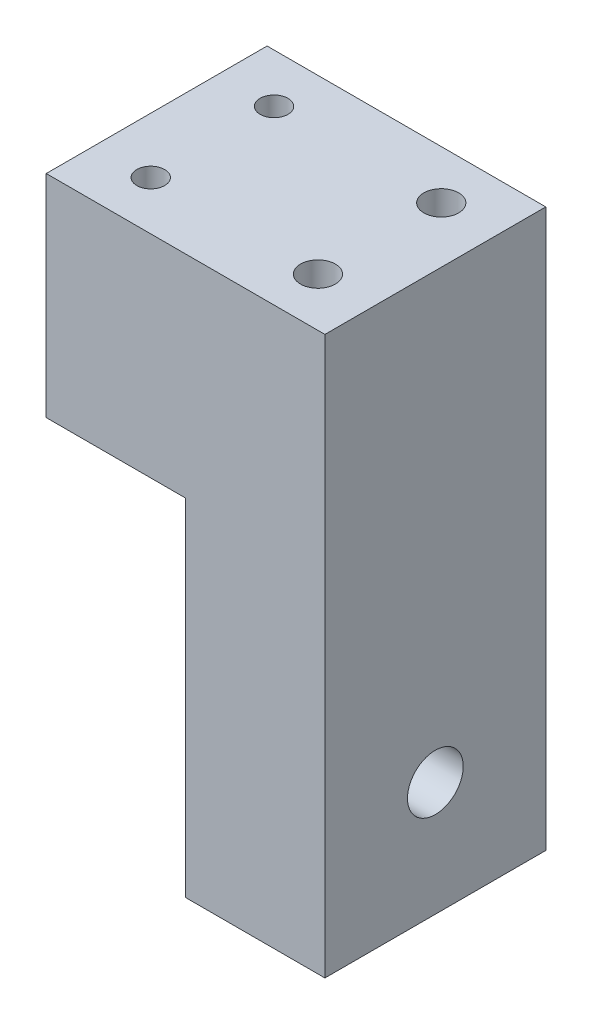
ISO-10303-21;
HEADER;
FILE_DESCRIPTION(('STEP AP214'),'2;1');
FILE_NAME('part.step','',(''),(''),'','','');
FILE_SCHEMA(('AUTOMOTIVE_DESIGN { 1 0 10303 214 1 1 1 1 }'));
ENDSEC;
DATA;
#1=APPLICATION_CONTEXT('core data for automotive mechanical design processes');
#2=APPLICATION_PROTOCOL_DEFINITION('international standard','automotive_design',2000,#1);
#3=PRODUCT_CONTEXT('',#1,'mechanical');
#4=PRODUCT('Part','Part','',(#3));
#5=PRODUCT_RELATED_PRODUCT_CATEGORY('part','',(#4));
#6=PRODUCT_DEFINITION_FORMATION('','',#4);
#7=PRODUCT_DEFINITION_CONTEXT('part definition',#1,'design');
#8=PRODUCT_DEFINITION('design','',#6,#7);
#9=PRODUCT_DEFINITION_SHAPE('','',#8);
#10=(LENGTH_UNIT() NAMED_UNIT(*) SI_UNIT(.MILLI.,.METRE.));
#11=(NAMED_UNIT(*) PLANE_ANGLE_UNIT() SI_UNIT($,.RADIAN.));
#12=(NAMED_UNIT(*) SI_UNIT($,.STERADIAN.) SOLID_ANGLE_UNIT());
#13=UNCERTAINTY_MEASURE_WITH_UNIT(LENGTH_MEASURE(1.E-05),#10,'distance_accuracy_value','');
#14=(GEOMETRIC_REPRESENTATION_CONTEXT(3) GLOBAL_UNCERTAINTY_ASSIGNED_CONTEXT((#13)) GLOBAL_UNIT_ASSIGNED_CONTEXT((#10,
#11,#12)) REPRESENTATION_CONTEXT('',''));
#15=CARTESIAN_POINT('',(0.,0.,0.));
#16=DIRECTION('',(0.,0.,1.));
#17=DIRECTION('',(1.,0.,0.));
#18=AXIS2_PLACEMENT_3D('',#15,#16,#17);
#19=CARTESIAN_POINT('',(-4.34310787671234,80.,-11.796875));
#20=DIRECTION('',(1.,0.,0.));
#21=DIRECTION('',(0.,0.,-1.));
#22=AXIS2_PLACEMENT_3D('',#19,#20,#21);
#23=PLANE('',#22);
#24=CARTESIAN_POINT('',(-4.34310787671234,16.3903547365967,4.05312500000005));
#25=DIRECTION('',(-1.,0.,0.));
#26=DIRECTION('',(0.,0.,1.));
#27=AXIS2_PLACEMENT_3D('',#24,#25,#26);
#28=CIRCLE('',#27,4.);
#29=CARTESIAN_POINT('',(-4.34310787671234,16.3903547365967,8.05312500000005));
#30=VERTEX_POINT('',#29);
#31=EDGE_CURVE('E103',#30,#30,#28,.T.);
#32=ORIENTED_EDGE('',*,*,#31,.F.);
#33=EDGE_LOOP('',(#32));
#34=FACE_BOUND('',#33,.T.);
#35=CARTESIAN_POINT('',(-4.34310787671234,3.83920937053546,16.6042703660613));
#36=DIRECTION('',(-1.,0.,0.));
#37=DIRECTION('',(0.,0.,1.));
#38=AXIS2_PLACEMENT_3D('',#35,#36,#37);
#39=CIRCLE('',#38,1.24999999999999);
#40=CARTESIAN_POINT('',(-4.34310787671234,3.83920937053546,17.8542703660612));
#41=VERTEX_POINT('',#40);
#42=EDGE_CURVE('E164',#41,#41,#39,.T.);
#43=ORIENTED_EDGE('',*,*,#42,.F.);
#44=EDGE_LOOP('',(#43));
#45=FACE_BOUND('',#44,.T.);
#46=CARTESIAN_POINT('',(-4.34310787671234,3.83920937053546,-8.49802036606119));
#47=DIRECTION('',(-1.,0.,0.));
#48=DIRECTION('',(0.,0.,1.));
#49=AXIS2_PLACEMENT_3D('',#46,#47,#48);
#50=CIRCLE('',#49,1.24999999999999);
#51=CARTESIAN_POINT('',(-4.34310787671234,3.83920937053546,-7.2480203660612));
#52=VERTEX_POINT('',#51);
#53=EDGE_CURVE('E158',#52,#52,#50,.T.);
#54=ORIENTED_EDGE('',*,*,#53,.F.);
#55=EDGE_LOOP('',(#54));
#56=FACE_BOUND('',#55,.T.);
#57=CARTESIAN_POINT('',(-4.34310787671234,28.9415001026579,-8.49802036606118));
#58=DIRECTION('',(-1.,0.,0.));
#59=DIRECTION('',(0.,0.,1.));
#60=AXIS2_PLACEMENT_3D('',#57,#58,#59);
#61=CIRCLE('',#60,1.24999999999999);
#62=CARTESIAN_POINT('',(-4.34310787671234,28.9415001026579,-7.2480203660612));
#63=VERTEX_POINT('',#62);
#64=EDGE_CURVE('E152',#63,#63,#61,.T.);
#65=ORIENTED_EDGE('',*,*,#64,.F.);
#66=EDGE_LOOP('',(#65));
#67=FACE_BOUND('',#66,.T.);
#68=CARTESIAN_POINT('',(-4.34310787671234,28.9415001026579,16.6042703660613));
#69=DIRECTION('',(-1.,0.,0.));
#70=DIRECTION('',(0.,0.,1.));
#71=AXIS2_PLACEMENT_3D('',#68,#69,#70);
#72=CIRCLE('',#71,1.24999999999999);
#73=CARTESIAN_POINT('',(-4.34310787671234,28.9415001026579,17.8542703660613));
#74=VERTEX_POINT('',#73);
#75=EDGE_CURVE('E146',#74,#74,#72,.T.);
#76=ORIENTED_EDGE('',*,*,#75,.F.);
#77=EDGE_LOOP('',(#76));
#78=FACE_BOUND('',#77,.T.);
#79=DIRECTION('',(0.,0.,1.));
#80=VECTOR('',#79,1.);
#81=CARTESIAN_POINT('',(-4.34310787671234,49.655452772484,-11.796875));
#82=LINE('',#81,#80);
#83=CARTESIAN_POINT('',(-4.34310787671234,49.655452772484,-11.796875));
#84=VERTEX_POINT('',#83);
#85=CARTESIAN_POINT('',(-4.34310787671234,49.655452772484,19.903125));
#86=VERTEX_POINT('',#85);
#87=EDGE_CURVE('E52',#84,#86,#82,.T.);
#88=ORIENTED_EDGE('',*,*,#87,.F.);
#89=DIRECTION('',(0.,-1.,0.));
#90=VECTOR('',#89,1.);
#91=CARTESIAN_POINT('',(-4.34310787671234,80.,-11.796875));
#92=LINE('',#91,#90);
#93=CARTESIAN_POINT('',(-4.34310787671234,0.,-11.796875));
#94=VERTEX_POINT('',#93);
#95=EDGE_CURVE('E76',#84,#94,#92,.T.);
#96=ORIENTED_EDGE('',*,*,#95,.T.);
#97=DIRECTION('',(0.,0.,1.));
#98=VECTOR('',#97,1.);
#99=CARTESIAN_POINT('',(-4.34310787671234,0.,-11.796875));
#100=LINE('',#99,#98);
#101=CARTESIAN_POINT('',(-4.34310787671234,0.,19.903125));
#102=VERTEX_POINT('',#101);
#103=EDGE_CURVE('E79',#94,#102,#100,.T.);
#104=ORIENTED_EDGE('',*,*,#103,.T.);
#105=DIRECTION('',(0.,-1.,0.));
#106=VECTOR('',#105,1.);
#107=CARTESIAN_POINT('',(-4.34310787671234,80.,19.903125));
#108=LINE('',#107,#106);
#109=EDGE_CURVE('E11',#86,#102,#108,.T.);
#110=ORIENTED_EDGE('',*,*,#109,.F.);
#111=EDGE_LOOP('',(#88,#96,#104,#110));
#112=FACE_BOUND('',#111,.T.);
#113=ADVANCED_FACE('F38',(#34,#45,#56,#67,#78,#112),#23,.F.);
#114=CARTESIAN_POINT('',(-4.34310787671234,80.,19.903125));
#115=DIRECTION('',(0.,0.,-1.));
#116=DIRECTION('',(-1.,0.,0.));
#117=AXIS2_PLACEMENT_3D('',#114,#115,#116);
#118=PLANE('',#117);
#119=DIRECTION('',(1.,0.,0.));
#120=VECTOR('',#119,1.);
#121=CARTESIAN_POINT('',(-4.34310787671234,0.,19.903125));
#122=LINE('',#121,#120);
#123=CARTESIAN_POINT('',(15.6568921232877,0.,19.903125));
#124=VERTEX_POINT('',#123);
#125=EDGE_CURVE('E98',#102,#124,#122,.T.);
#126=ORIENTED_EDGE('',*,*,#125,.T.);
#127=DIRECTION('',(0.,-1.,0.));
#128=VECTOR('',#127,1.);
#129=CARTESIAN_POINT('',(15.6568921232877,80.,19.903125));
#130=LINE('',#129,#128);
#131=CARTESIAN_POINT('',(15.6568921232877,80.,19.903125));
#132=VERTEX_POINT('',#131);
#133=EDGE_CURVE('E45',#132,#124,#130,.T.);
#134=ORIENTED_EDGE('',*,*,#133,.F.);
#135=DIRECTION('',(1.,0.,0.));
#136=VECTOR('',#135,1.);
#137=CARTESIAN_POINT('',(-4.34310787671234,80.,19.903125));
#138=LINE('',#137,#136);
#139=CARTESIAN_POINT('',(-24.3431078767123,80.,19.903125));
#140=VERTEX_POINT('',#139);
#141=EDGE_CURVE('E93',#140,#132,#138,.T.);
#142=ORIENTED_EDGE('',*,*,#141,.F.);
#143=DIRECTION('',(0.,1.,0.));
#144=VECTOR('',#143,1.);
#145=CARTESIAN_POINT('',(-24.3431078767123,49.655452772484,19.903125));
#146=LINE('',#145,#144);
#147=CARTESIAN_POINT('',(-24.3431078767123,49.655452772484,19.903125));
#148=VERTEX_POINT('',#147);
#149=EDGE_CURVE('E182',#148,#140,#146,.T.);
#150=ORIENTED_EDGE('',*,*,#149,.F.);
#151=DIRECTION('',(1.,0.,0.));
#152=VECTOR('',#151,1.);
#153=CARTESIAN_POINT('',(-24.3431078767123,49.655452772484,19.903125));
#154=LINE('',#153,#152);
#155=EDGE_CURVE('E122',#148,#86,#154,.T.);
#156=ORIENTED_EDGE('',*,*,#155,.T.);
#157=ORIENTED_EDGE('',*,*,#109,.T.);
#158=EDGE_LOOP('',(#126,#134,#142,#150,#156,#157));
#159=FACE_BOUND('',#158,.T.);
#160=ADVANCED_FACE('F115',(#159),#118,.F.);
#161=CARTESIAN_POINT('',(15.6568921232877,80.,-11.796875));
#162=DIRECTION('',(-1.,0.,0.));
#163=DIRECTION('',(0.,0.,1.));
#164=AXIS2_PLACEMENT_3D('',#161,#162,#163);
#165=PLANE('',#164);
#166=CARTESIAN_POINT('',(15.6568921232877,16.3903547365967,4.05312500000005));
#167=DIRECTION('',(-1.,0.,0.));
#168=DIRECTION('',(0.,0.,1.));
#169=AXIS2_PLACEMENT_3D('',#166,#167,#168);
#170=CIRCLE('',#169,4.);
#171=CARTESIAN_POINT('',(15.6568921232877,16.3903547365967,8.05312500000005));
#172=VERTEX_POINT('',#171);
#173=EDGE_CURVE('E99',#172,#172,#170,.F.);
#174=ORIENTED_EDGE('',*,*,#173,.F.);
#175=EDGE_LOOP('',(#174));
#176=FACE_BOUND('',#175,.T.);
#177=DIRECTION('',(0.,0.,-1.));
#178=VECTOR('',#177,1.);
#179=CARTESIAN_POINT('',(15.6568921232877,0.,-11.796875));
#180=LINE('',#179,#178);
#181=CARTESIAN_POINT('',(15.6568921232877,0.,-11.796875));
#182=VERTEX_POINT('',#181);
#183=EDGE_CURVE('E94',#124,#182,#180,.T.);
#184=ORIENTED_EDGE('',*,*,#183,.T.);
#185=DIRECTION('',(0.,-1.,0.));
#186=VECTOR('',#185,1.);
#187=CARTESIAN_POINT('',(15.6568921232877,80.,-11.796875));
#188=LINE('',#187,#186);
#189=CARTESIAN_POINT('',(15.6568921232877,80.,-11.796875));
#190=VERTEX_POINT('',#189);
#191=EDGE_CURVE('E83',#190,#182,#188,.T.);
#192=ORIENTED_EDGE('',*,*,#191,.F.);
#193=DIRECTION('',(0.,0.,-1.));
#194=VECTOR('',#193,1.);
#195=CARTESIAN_POINT('',(15.6568921232877,80.,-11.796875));
#196=LINE('',#195,#194);
#197=EDGE_CURVE('E61',#132,#190,#196,.T.);
#198=ORIENTED_EDGE('',*,*,#197,.F.);
#199=ORIENTED_EDGE('',*,*,#133,.T.);
#200=EDGE_LOOP('',(#184,#192,#198,#199));
#201=FACE_BOUND('',#200,.T.);
#202=ADVANCED_FACE('F112',(#176,#201),#165,.F.);
#203=CARTESIAN_POINT('',(-4.34310787671234,80.,-11.796875));
#204=DIRECTION('',(0.,0.,1.));
#205=DIRECTION('',(1.,0.,0.));
#206=AXIS2_PLACEMENT_3D('',#203,#204,#205);
#207=PLANE('',#206);
#208=DIRECTION('',(-1.,0.,0.));
#209=VECTOR('',#208,1.);
#210=CARTESIAN_POINT('',(-4.34310787671234,0.,-11.796875));
#211=LINE('',#210,#209);
#212=EDGE_CURVE('E88',#182,#94,#211,.T.);
#213=ORIENTED_EDGE('',*,*,#212,.T.);
#214=ORIENTED_EDGE('',*,*,#95,.F.);
#215=DIRECTION('',(1.,0.,0.));
#216=VECTOR('',#215,1.);
#217=CARTESIAN_POINT('',(-24.3431078767123,49.655452772484,-11.796875));
#218=LINE('',#217,#216);
#219=CARTESIAN_POINT('',(-24.3431078767123,49.655452772484,-11.796875));
#220=VERTEX_POINT('',#219);
#221=EDGE_CURVE('E130',#220,#84,#218,.T.);
#222=ORIENTED_EDGE('',*,*,#221,.F.);
#223=DIRECTION('',(0.,-1.,0.));
#224=VECTOR('',#223,1.);
#225=CARTESIAN_POINT('',(-24.3431078767123,49.655452772484,-11.796875));
#226=LINE('',#225,#224);
#227=CARTESIAN_POINT('',(-24.3431078767123,80.,-11.796875));
#228=VERTEX_POINT('',#227);
#229=EDGE_CURVE('E131',#228,#220,#226,.T.);
#230=ORIENTED_EDGE('',*,*,#229,.F.);
#231=DIRECTION('',(-1.,0.,0.));
#232=VECTOR('',#231,1.);
#233=CARTESIAN_POINT('',(-4.34310787671234,80.,-11.796875));
#234=LINE('',#233,#232);
#235=EDGE_CURVE('E84',#190,#228,#234,.T.);
#236=ORIENTED_EDGE('',*,*,#235,.F.);
#237=ORIENTED_EDGE('',*,*,#191,.T.);
#238=EDGE_LOOP('',(#213,#214,#222,#230,#236,#237));
#239=FACE_BOUND('',#238,.T.);
#240=ADVANCED_FACE('F89',(#239),#207,.F.);
#241=CARTESIAN_POINT('',(0.,80.,0.));
#242=DIRECTION('',(0.,1.,0.));
#243=DIRECTION('',(0.,0.,1.));
#244=AXIS2_PLACEMENT_3D('',#241,#242,#243);
#245=PLANE('',#244);
#246=CARTESIAN_POINT('',(7.65689212328766,80.,-4.796875));
#247=DIRECTION('',(0.,1.,0.));
#248=DIRECTION('',(0.,0.,1.));
#249=AXIS2_PLACEMENT_3D('',#246,#247,#248);
#250=CIRCLE('',#249,2.5);
#251=CARTESIAN_POINT('',(7.65689212328766,80.,-2.296875));
#252=VERTEX_POINT('',#251);
#253=EDGE_CURVE('E495',#252,#252,#250,.T.);
#254=ORIENTED_EDGE('',*,*,#253,.F.);
#255=EDGE_LOOP('',(#254));
#256=FACE_BOUND('',#255,.T.);
#257=CARTESIAN_POINT('',(7.65689212328766,80.,12.903125));
#258=DIRECTION('',(0.,1.,0.));
#259=DIRECTION('',(0.,0.,1.));
#260=AXIS2_PLACEMENT_3D('',#257,#258,#259);
#261=CIRCLE('',#260,2.5);
#262=CARTESIAN_POINT('',(7.65689212328766,80.,15.403125));
#263=VERTEX_POINT('',#262);
#264=EDGE_CURVE('E497',#263,#263,#261,.T.);
#265=ORIENTED_EDGE('',*,*,#264,.F.);
#266=EDGE_LOOP('',(#265));
#267=FACE_BOUND('',#266,.T.);
#268=CARTESIAN_POINT('',(-16.3431078767123,80.,-4.796875));
#269=DIRECTION('',(0.,1.,0.));
#270=DIRECTION('',(0.,0.,1.));
#271=AXIS2_PLACEMENT_3D('',#268,#269,#270);
#272=CIRCLE('',#271,1.99999999999999);
#273=CARTESIAN_POINT('',(-16.3431078767123,80.,-2.79687500000001));
#274=VERTEX_POINT('',#273);
#275=EDGE_CURVE('E505',#274,#274,#272,.T.);
#276=ORIENTED_EDGE('',*,*,#275,.F.);
#277=EDGE_LOOP('',(#276));
#278=FACE_BOUND('',#277,.T.);
#279=CARTESIAN_POINT('',(-16.3431078767123,80.,12.903125));
#280=DIRECTION('',(0.,1.,0.));
#281=DIRECTION('',(0.,0.,1.));
#282=AXIS2_PLACEMENT_3D('',#279,#280,#281);
#283=CIRCLE('',#282,1.99999999999999);
#284=CARTESIAN_POINT('',(-16.3431078767123,80.,14.903125));
#285=VERTEX_POINT('',#284);
#286=EDGE_CURVE('E138',#285,#285,#283,.T.);
#287=ORIENTED_EDGE('',*,*,#286,.F.);
#288=EDGE_LOOP('',(#287));
#289=FACE_BOUND('',#288,.T.);
#290=ORIENTED_EDGE('',*,*,#235,.T.);
#291=DIRECTION('',(0.,0.,-1.));
#292=VECTOR('',#291,1.);
#293=CARTESIAN_POINT('',(-24.3431078767123,80.,-11.796875));
#294=LINE('',#293,#292);
#295=EDGE_CURVE('E142',#140,#228,#294,.T.);
#296=ORIENTED_EDGE('',*,*,#295,.F.);
#297=ORIENTED_EDGE('',*,*,#141,.T.);
#298=ORIENTED_EDGE('',*,*,#197,.T.);
#299=EDGE_LOOP('',(#290,#296,#297,#298));
#300=FACE_BOUND('',#299,.T.);
#301=ADVANCED_FACE('F175',(#256,#267,#278,#289,#300),#245,.T.);
#302=CARTESIAN_POINT('',(0.,0.,0.));
#303=DIRECTION('',(0.,1.,0.));
#304=DIRECTION('',(0.,0.,1.));
#305=AXIS2_PLACEMENT_3D('',#302,#303,#304);
#306=PLANE('',#305);
#307=ORIENTED_EDGE('',*,*,#103,.F.);
#308=ORIENTED_EDGE('',*,*,#212,.F.);
#309=ORIENTED_EDGE('',*,*,#183,.F.);
#310=ORIENTED_EDGE('',*,*,#125,.F.);
#311=EDGE_LOOP('',(#307,#308,#309,#310));
#312=FACE_BOUND('',#311,.T.);
#313=ADVANCED_FACE('F97',(#312),#306,.F.);
#314=CARTESIAN_POINT('',(15.6578921232877,16.3903547365967,4.05312500000005));
#315=DIRECTION('',(-1.,0.,0.));
#316=DIRECTION('',(0.,0.,1.));
#317=AXIS2_PLACEMENT_3D('',#314,#315,#316);
#318=CYLINDRICAL_SURFACE('',#317,4.);
#319=ORIENTED_EDGE('',*,*,#31,.T.);
#320=EDGE_LOOP('',(#319));
#321=FACE_BOUND('',#320,.T.);
#322=ORIENTED_EDGE('',*,*,#173,.T.);
#323=EDGE_LOOP('',(#322));
#324=FACE_BOUND('',#323,.T.);
#325=ADVANCED_FACE('F202',(#321,#324),#318,.F.);
#326=CARTESIAN_POINT('',(3.15689212328766,3.83920937053546,16.6042703660613));
#327=DIRECTION('',(-1.,0.,0.));
#328=DIRECTION('',(0.,0.,1.));
#329=AXIS2_PLACEMENT_3D('',#326,#327,#328);
#330=CONICAL_SURFACE('',#329,1.24999999999999,1.02974425867664);
#331=CARTESIAN_POINT('',(3.90796789707212,3.83920937053545,16.6042703660613));
#332=VERTEX_POINT('',#331);
#333=VERTEX_LOOP('',#332);
#334=FACE_BOUND('',#333,.T.);
#335=CARTESIAN_POINT('',(3.15689212328766,3.83920937053546,16.6042703660613));
#336=DIRECTION('',(-1.,0.,0.));
#337=DIRECTION('',(0.,0.,1.));
#338=AXIS2_PLACEMENT_3D('',#335,#336,#337);
#339=CIRCLE('',#338,1.24999999999999);
#340=CARTESIAN_POINT('',(3.15689212328766,3.83920937053546,17.8542703660612));
#341=VERTEX_POINT('',#340);
#342=EDGE_CURVE('E167',#341,#341,#339,.T.);
#343=ORIENTED_EDGE('',*,*,#342,.T.);
#344=EDGE_LOOP('',(#343));
#345=FACE_BOUND('',#344,.T.);
#346=ADVANCED_FACE('F198',(#334,#345),#330,.F.);
#347=CARTESIAN_POINT('',(-4.34310787671234,3.83920937053546,16.6042703660613));
#348=DIRECTION('',(-1.,0.,0.));
#349=DIRECTION('',(0.,0.,1.));
#350=AXIS2_PLACEMENT_3D('',#347,#348,#349);
#351=CYLINDRICAL_SURFACE('',#350,1.24999999999999);
#352=ORIENTED_EDGE('',*,*,#342,.F.);
#353=EDGE_LOOP('',(#352));
#354=FACE_BOUND('',#353,.T.);
#355=ORIENTED_EDGE('',*,*,#42,.T.);
#356=EDGE_LOOP('',(#355));
#357=FACE_BOUND('',#356,.T.);
#358=ADVANCED_FACE('F201',(#354,#357),#351,.F.);
#359=CARTESIAN_POINT('',(3.15689212328765,3.83920937053546,-8.49802036606119));
#360=DIRECTION('',(-1.,0.,0.));
#361=DIRECTION('',(0.,0.,1.));
#362=AXIS2_PLACEMENT_3D('',#359,#360,#361);
#363=CONICAL_SURFACE('',#362,1.24999999999999,1.02974425867664);
#364=CARTESIAN_POINT('',(3.90796789707211,3.83920937053546,-8.49802036606119));
#365=VERTEX_POINT('',#364);
#366=VERTEX_LOOP('',#365);
#367=FACE_BOUND('',#366,.T.);
#368=CARTESIAN_POINT('',(3.15689212328765,3.83920937053546,-8.49802036606119));
#369=DIRECTION('',(-1.,0.,0.));
#370=DIRECTION('',(0.,0.,1.));
#371=AXIS2_PLACEMENT_3D('',#368,#369,#370);
#372=CIRCLE('',#371,1.24999999999999);
#373=CARTESIAN_POINT('',(3.15689212328765,3.83920937053546,-7.2480203660612));
#374=VERTEX_POINT('',#373);
#375=EDGE_CURVE('E161',#374,#374,#372,.T.);
#376=ORIENTED_EDGE('',*,*,#375,.T.);
#377=EDGE_LOOP('',(#376));
#378=FACE_BOUND('',#377,.T.);
#379=ADVANCED_FACE('F208',(#367,#378),#363,.F.);
#380=CARTESIAN_POINT('',(-4.34310787671234,3.83920937053546,-8.49802036606119));
#381=DIRECTION('',(-1.,0.,0.));
#382=DIRECTION('',(0.,0.,1.));
#383=AXIS2_PLACEMENT_3D('',#380,#381,#382);
#384=CYLINDRICAL_SURFACE('',#383,1.24999999999999);
#385=ORIENTED_EDGE('',*,*,#375,.F.);
#386=EDGE_LOOP('',(#385));
#387=FACE_BOUND('',#386,.T.);
#388=ORIENTED_EDGE('',*,*,#53,.T.);
#389=EDGE_LOOP('',(#388));
#390=FACE_BOUND('',#389,.T.);
#391=ADVANCED_FACE('F243',(#387,#390),#384,.F.);
#392=CARTESIAN_POINT('',(3.15689212328765,28.9415001026579,-8.49802036606118));
#393=DIRECTION('',(-1.,0.,0.));
#394=DIRECTION('',(0.,0.,1.));
#395=AXIS2_PLACEMENT_3D('',#392,#393,#394);
#396=CONICAL_SURFACE('',#395,1.24999999999999,1.02974425867664);
#397=CARTESIAN_POINT('',(3.90796789707211,28.9415001026579,-8.49802036606118));
#398=VERTEX_POINT('',#397);
#399=VERTEX_LOOP('',#398);
#400=FACE_BOUND('',#399,.T.);
#401=CARTESIAN_POINT('',(3.15689212328765,28.9415001026579,-8.49802036606118));
#402=DIRECTION('',(-1.,0.,0.));
#403=DIRECTION('',(0.,0.,1.));
#404=AXIS2_PLACEMENT_3D('',#401,#402,#403);
#405=CIRCLE('',#404,1.24999999999999);
#406=CARTESIAN_POINT('',(3.15689212328765,28.9415001026579,-7.2480203660612));
#407=VERTEX_POINT('',#406);
#408=EDGE_CURVE('E155',#407,#407,#405,.T.);
#409=ORIENTED_EDGE('',*,*,#408,.T.);
#410=EDGE_LOOP('',(#409));
#411=FACE_BOUND('',#410,.T.);
#412=ADVANCED_FACE('F239',(#400,#411),#396,.F.);
#413=CARTESIAN_POINT('',(-4.34310787671234,28.9415001026579,-8.49802036606118));
#414=DIRECTION('',(-1.,0.,0.));
#415=DIRECTION('',(0.,0.,1.));
#416=AXIS2_PLACEMENT_3D('',#413,#414,#415);
#417=CYLINDRICAL_SURFACE('',#416,1.24999999999999);
#418=ORIENTED_EDGE('',*,*,#408,.F.);
#419=EDGE_LOOP('',(#418));
#420=FACE_BOUND('',#419,.T.);
#421=ORIENTED_EDGE('',*,*,#64,.T.);
#422=EDGE_LOOP('',(#421));
#423=FACE_BOUND('',#422,.T.);
#424=ADVANCED_FACE('F231',(#420,#423),#417,.F.);
#425=CARTESIAN_POINT('',(3.15689212328766,28.9415001026579,16.6042703660613));
#426=DIRECTION('',(-1.,0.,0.));
#427=DIRECTION('',(0.,0.,1.));
#428=AXIS2_PLACEMENT_3D('',#425,#426,#427);
#429=CONICAL_SURFACE('',#428,1.24999999999999,1.02974425867664);
#430=CARTESIAN_POINT('',(3.90796789707212,28.9415001026579,16.6042703660613));
#431=VERTEX_POINT('',#430);
#432=VERTEX_LOOP('',#431);
#433=FACE_BOUND('',#432,.T.);
#434=CARTESIAN_POINT('',(3.15689212328766,28.9415001026579,16.6042703660613));
#435=DIRECTION('',(-1.,0.,0.));
#436=DIRECTION('',(0.,0.,1.));
#437=AXIS2_PLACEMENT_3D('',#434,#435,#436);
#438=CIRCLE('',#437,1.24999999999999);
#439=CARTESIAN_POINT('',(3.15689212328766,28.9415001026579,17.8542703660612));
#440=VERTEX_POINT('',#439);
#441=EDGE_CURVE('E149',#440,#440,#438,.T.);
#442=ORIENTED_EDGE('',*,*,#441,.T.);
#443=EDGE_LOOP('',(#442));
#444=FACE_BOUND('',#443,.T.);
#445=ADVANCED_FACE('F223',(#433,#444),#429,.F.);
#446=CARTESIAN_POINT('',(-4.34310787671234,28.9415001026579,16.6042703660613));
#447=DIRECTION('',(-1.,0.,0.));
#448=DIRECTION('',(0.,0.,1.));
#449=AXIS2_PLACEMENT_3D('',#446,#447,#448);
#450=CYLINDRICAL_SURFACE('',#449,1.24999999999999);
#451=ORIENTED_EDGE('',*,*,#441,.F.);
#452=EDGE_LOOP('',(#451));
#453=FACE_BOUND('',#452,.T.);
#454=ORIENTED_EDGE('',*,*,#75,.T.);
#455=EDGE_LOOP('',(#454));
#456=FACE_BOUND('',#455,.T.);
#457=ADVANCED_FACE('F221',(#453,#456),#450,.F.);
#458=CARTESIAN_POINT('',(-24.3431078767123,49.655452772484,-11.796875));
#459=DIRECTION('',(0.,1.,0.));
#460=DIRECTION('',(0.,0.,1.));
#461=AXIS2_PLACEMENT_3D('',#458,#459,#460);
#462=PLANE('',#461);
#463=ORIENTED_EDGE('',*,*,#87,.T.);
#464=ORIENTED_EDGE('',*,*,#155,.F.);
#465=DIRECTION('',(0.,0.,1.));
#466=VECTOR('',#465,1.);
#467=CARTESIAN_POINT('',(-24.3431078767123,49.655452772484,-11.796875));
#468=LINE('',#467,#466);
#469=EDGE_CURVE('E135',#220,#148,#468,.T.);
#470=ORIENTED_EDGE('',*,*,#469,.F.);
#471=ORIENTED_EDGE('',*,*,#221,.T.);
#472=EDGE_LOOP('',(#463,#464,#470,#471));
#473=FACE_BOUND('',#472,.T.);
#474=ADVANCED_FACE('F127',(#473),#462,.F.);
#475=CARTESIAN_POINT('',(-24.3431078767123,0.,0.));
#476=DIRECTION('',(1.,0.,0.));
#477=DIRECTION('',(0.,0.,-1.));
#478=AXIS2_PLACEMENT_3D('',#475,#476,#477);
#479=PLANE('',#478);
#480=ORIENTED_EDGE('',*,*,#229,.T.);
#481=ORIENTED_EDGE('',*,*,#469,.T.);
#482=ORIENTED_EDGE('',*,*,#149,.T.);
#483=ORIENTED_EDGE('',*,*,#295,.T.);
#484=EDGE_LOOP('',(#480,#481,#482,#483));
#485=FACE_BOUND('',#484,.T.);
#486=ADVANCED_FACE('F180',(#485),#479,.F.);
#487=CARTESIAN_POINT('',(-16.3431078767123,74.8,12.903125));
#488=DIRECTION('',(0.,1.,0.));
#489=DIRECTION('',(0.,0.,1.));
#490=AXIS2_PLACEMENT_3D('',#487,#488,#489);
#491=CONICAL_SURFACE('',#490,1.99999999999999,1.02974425867665);
#492=CARTESIAN_POINT('',(-16.3431078767123,73.5982787619449,12.903125));
#493=VERTEX_POINT('',#492);
#494=VERTEX_LOOP('',#493);
#495=FACE_BOUND('',#494,.T.);
#496=CARTESIAN_POINT('',(-16.3431078767123,74.8,12.903125));
#497=DIRECTION('',(0.,1.,0.));
#498=DIRECTION('',(0.,0.,1.));
#499=AXIS2_PLACEMENT_3D('',#496,#497,#498);
#500=CIRCLE('',#499,1.99999999999999);
#501=CARTESIAN_POINT('',(-16.3431078767123,74.8,14.903125));
#502=VERTEX_POINT('',#501);
#503=EDGE_CURVE('E132',#502,#502,#500,.T.);
#504=ORIENTED_EDGE('',*,*,#503,.T.);
#505=EDGE_LOOP('',(#504));
#506=FACE_BOUND('',#505,.T.);
#507=ADVANCED_FACE('F397',(#495,#506),#491,.F.);
#508=CARTESIAN_POINT('',(-16.3431078767123,80.,12.903125));
#509=DIRECTION('',(0.,1.,0.));
#510=DIRECTION('',(0.,0.,1.));
#511=AXIS2_PLACEMENT_3D('',#508,#509,#510);
#512=CYLINDRICAL_SURFACE('',#511,1.99999999999999);
#513=ORIENTED_EDGE('',*,*,#503,.F.);
#514=EDGE_LOOP('',(#513));
#515=FACE_BOUND('',#514,.T.);
#516=ORIENTED_EDGE('',*,*,#286,.T.);
#517=EDGE_LOOP('',(#516));
#518=FACE_BOUND('',#517,.T.);
#519=ADVANCED_FACE('F404',(#515,#518),#512,.F.);
#520=CARTESIAN_POINT('',(-16.3431078767123,74.8,-4.796875));
#521=DIRECTION('',(0.,1.,0.));
#522=DIRECTION('',(0.,0.,1.));
#523=AXIS2_PLACEMENT_3D('',#520,#521,#522);
#524=CONICAL_SURFACE('',#523,1.99999999999999,1.02974425867665);
#525=CARTESIAN_POINT('',(-16.3431078767123,73.5982787619449,-4.796875));
#526=VERTEX_POINT('',#525);
#527=VERTEX_LOOP('',#526);
#528=FACE_BOUND('',#527,.T.);
#529=CARTESIAN_POINT('',(-16.3431078767123,74.8,-4.796875));
#530=DIRECTION('',(0.,1.,0.));
#531=DIRECTION('',(0.,0.,1.));
#532=AXIS2_PLACEMENT_3D('',#529,#530,#531);
#533=CIRCLE('',#532,1.99999999999999);
#534=CARTESIAN_POINT('',(-16.3431078767123,74.8,-2.79687500000001));
#535=VERTEX_POINT('',#534);
#536=EDGE_CURVE('E508',#535,#535,#533,.T.);
#537=ORIENTED_EDGE('',*,*,#536,.T.);
#538=EDGE_LOOP('',(#537));
#539=FACE_BOUND('',#538,.T.);
#540=ADVANCED_FACE('F413',(#528,#539),#524,.F.);
#541=CARTESIAN_POINT('',(-16.3431078767123,80.,-4.796875));
#542=DIRECTION('',(0.,1.,0.));
#543=DIRECTION('',(0.,0.,1.));
#544=AXIS2_PLACEMENT_3D('',#541,#542,#543);
#545=CYLINDRICAL_SURFACE('',#544,1.99999999999999);
#546=ORIENTED_EDGE('',*,*,#536,.F.);
#547=EDGE_LOOP('',(#546));
#548=FACE_BOUND('',#547,.T.);
#549=ORIENTED_EDGE('',*,*,#275,.T.);
#550=EDGE_LOOP('',(#549));
#551=FACE_BOUND('',#550,.T.);
#552=ADVANCED_FACE('F422',(#548,#551),#545,.F.);
#553=CARTESIAN_POINT('',(7.65689212328766,65.,12.903125));
#554=DIRECTION('',(0.,1.,0.));
#555=DIRECTION('',(0.,0.,1.));
#556=AXIS2_PLACEMENT_3D('',#553,#554,#555);
#557=CONICAL_SURFACE('',#556,2.5,1.02974425867665);
#558=CARTESIAN_POINT('',(7.65689212328766,63.4978484524311,12.903125));
#559=VERTEX_POINT('',#558);
#560=VERTEX_LOOP('',#559);
#561=FACE_BOUND('',#560,.T.);
#562=CARTESIAN_POINT('',(7.65689212328766,65.,12.903125));
#563=DIRECTION('',(0.,1.,0.));
#564=DIRECTION('',(0.,0.,1.));
#565=AXIS2_PLACEMENT_3D('',#562,#563,#564);
#566=CIRCLE('',#565,2.5);
#567=CARTESIAN_POINT('',(7.65689212328766,65.,15.403125));
#568=VERTEX_POINT('',#567);
#569=EDGE_CURVE('E502',#568,#568,#566,.T.);
#570=ORIENTED_EDGE('',*,*,#569,.T.);
#571=EDGE_LOOP('',(#570));
#572=FACE_BOUND('',#571,.T.);
#573=ADVANCED_FACE('F430',(#561,#572),#557,.F.);
#574=CARTESIAN_POINT('',(7.65689212328766,80.,12.903125));
#575=DIRECTION('',(0.,1.,0.));
#576=DIRECTION('',(0.,0.,1.));
#577=AXIS2_PLACEMENT_3D('',#574,#575,#576);
#578=CYLINDRICAL_SURFACE('',#577,2.5);
#579=ORIENTED_EDGE('',*,*,#569,.F.);
#580=EDGE_LOOP('',(#579));
#581=FACE_BOUND('',#580,.T.);
#582=ORIENTED_EDGE('',*,*,#264,.T.);
#583=EDGE_LOOP('',(#582));
#584=FACE_BOUND('',#583,.T.);
#585=ADVANCED_FACE('F438',(#581,#584),#578,.F.);
#586=CARTESIAN_POINT('',(7.65689212328766,65.,-4.796875));
#587=DIRECTION('',(0.,1.,0.));
#588=DIRECTION('',(0.,0.,1.));
#589=AXIS2_PLACEMENT_3D('',#586,#587,#588);
#590=CONICAL_SURFACE('',#589,2.5,1.02974425867665);
#591=CARTESIAN_POINT('',(7.65689212328766,63.4978484524311,-4.796875));
#592=VERTEX_POINT('',#591);
#593=VERTEX_LOOP('',#592);
#594=FACE_BOUND('',#593,.T.);
#595=CARTESIAN_POINT('',(7.65689212328766,65.,-4.796875));
#596=DIRECTION('',(0.,1.,0.));
#597=DIRECTION('',(0.,0.,1.));
#598=AXIS2_PLACEMENT_3D('',#595,#596,#597);
#599=CIRCLE('',#598,2.5);
#600=CARTESIAN_POINT('',(7.65689212328766,65.,-2.296875));
#601=VERTEX_POINT('',#600);
#602=EDGE_CURVE('E492',#601,#601,#599,.T.);
#603=ORIENTED_EDGE('',*,*,#602,.T.);
#604=EDGE_LOOP('',(#603));
#605=FACE_BOUND('',#604,.T.);
#606=ADVANCED_FACE('F447',(#594,#605),#590,.F.);
#607=CARTESIAN_POINT('',(7.65689212328766,80.,-4.796875));
#608=DIRECTION('',(0.,1.,0.));
#609=DIRECTION('',(0.,0.,1.));
#610=AXIS2_PLACEMENT_3D('',#607,#608,#609);
#611=CYLINDRICAL_SURFACE('',#610,2.5);
#612=ORIENTED_EDGE('',*,*,#602,.F.);
#613=EDGE_LOOP('',(#612));
#614=FACE_BOUND('',#613,.T.);
#615=ORIENTED_EDGE('',*,*,#253,.T.);
#616=EDGE_LOOP('',(#615));
#617=FACE_BOUND('',#616,.T.);
#618=ADVANCED_FACE('F456',(#614,#617),#611,.F.);
#619=CLOSED_SHELL('',(#113,#160,#202,#240,#301,#313,#325,#346,#358,#379,#391,#412,#424,#445,
#457,#474,#486,#507,#519,#540,#552,#573,#585,#606,#618));
#620=MANIFOLD_SOLID_BREP('B2',#619);
#621=ADVANCED_BREP_SHAPE_REPRESENTATION('',(#18,#620),#14);
#622=SHAPE_DEFINITION_REPRESENTATION(#9,#621);
ENDSEC;
END-ISO-10303-21;
